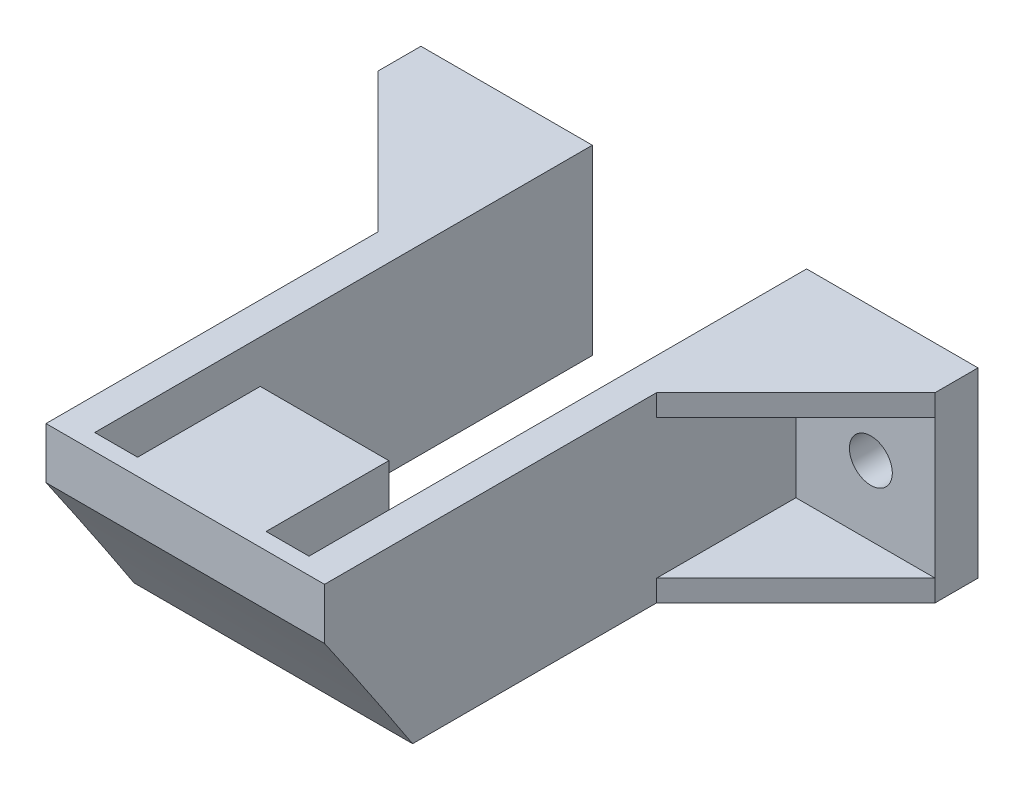
ISO-10303-21;
HEADER;
FILE_DESCRIPTION(('STEP AP214'),'2;1');
FILE_NAME('part.step','',(''),(''),'','','');
FILE_SCHEMA(('AUTOMOTIVE_DESIGN { 1 0 10303 214 1 1 1 1 }'));
ENDSEC;
DATA;
#1=APPLICATION_CONTEXT('core data for automotive mechanical design processes');
#2=APPLICATION_PROTOCOL_DEFINITION('international standard','automotive_design',2000,#1);
#3=PRODUCT_CONTEXT('',#1,'mechanical');
#4=PRODUCT('Part','Part','',(#3));
#5=PRODUCT_RELATED_PRODUCT_CATEGORY('part','',(#4));
#6=PRODUCT_DEFINITION_FORMATION('','',#4);
#7=PRODUCT_DEFINITION_CONTEXT('part definition',#1,'design');
#8=PRODUCT_DEFINITION('design','',#6,#7);
#9=PRODUCT_DEFINITION_SHAPE('','',#8);
#10=(LENGTH_UNIT() NAMED_UNIT(*) SI_UNIT(.MILLI.,.METRE.));
#11=(NAMED_UNIT(*) PLANE_ANGLE_UNIT() SI_UNIT($,.RADIAN.));
#12=(NAMED_UNIT(*) SI_UNIT($,.STERADIAN.) SOLID_ANGLE_UNIT());
#13=UNCERTAINTY_MEASURE_WITH_UNIT(LENGTH_MEASURE(1.E-05),#10,'distance_accuracy_value','');
#14=(GEOMETRIC_REPRESENTATION_CONTEXT(3) GLOBAL_UNCERTAINTY_ASSIGNED_CONTEXT((#13)) GLOBAL_UNIT_ASSIGNED_CONTEXT((#10,
#11,#12)) REPRESENTATION_CONTEXT('',''));
#15=CARTESIAN_POINT('',(0.,0.,0.));
#16=DIRECTION('',(0.,0.,1.));
#17=DIRECTION('',(1.,0.,0.));
#18=AXIS2_PLACEMENT_3D('',#15,#16,#17);
#19=CARTESIAN_POINT('',(28.0216094050633,17.,-27.3363714183997));
#20=DIRECTION('',(0.,0.,-1.));
#21=DIRECTION('',(-1.,0.,0.));
#22=AXIS2_PLACEMENT_3D('',#19,#20,#21);
#23=PLANE('',#22);
#24=CARTESIAN_POINT('',(22.0216094050633,8.5,-27.3363714183997));
#25=DIRECTION('',(0.,0.,-1.));
#26=DIRECTION('',(-1.,0.,0.));
#27=AXIS2_PLACEMENT_3D('',#24,#25,#26);
#28=CIRCLE('',#27,2.);
#29=CARTESIAN_POINT('',(20.0216094050633,8.5,-27.3363714183997));
#30=VERTEX_POINT('',#29);
#31=EDGE_CURVE('E356',#30,#30,#28,.T.);
#32=ORIENTED_EDGE('',*,*,#31,.T.);
#33=EDGE_LOOP('',(#32));
#34=FACE_BOUND('',#33,.T.);
#35=DIRECTION('',(1.,0.,0.));
#36=VECTOR('',#35,1.);
#37=CARTESIAN_POINT('',(28.0216094050633,2.,-27.3363714183997));
#38=LINE('',#37,#36);
#39=CARTESIAN_POINT('',(15.0216094050633,2.,-27.3363714183997));
#40=VERTEX_POINT('',#39);
#41=CARTESIAN_POINT('',(28.0216094050633,2.,-27.3363714183997));
#42=VERTEX_POINT('',#41);
#43=EDGE_CURVE('E359',#40,#42,#38,.T.);
#44=ORIENTED_EDGE('',*,*,#43,.T.);
#45=DIRECTION('',(0.,-1.,0.));
#46=VECTOR('',#45,1.);
#47=CARTESIAN_POINT('',(28.0216094050633,17.,-27.3363714183997));
#48=LINE('',#47,#46);
#49=CARTESIAN_POINT('',(28.0216094050633,15.,-27.3363714183997));
#50=VERTEX_POINT('',#49);
#51=EDGE_CURVE('E225',#50,#42,#48,.T.);
#52=ORIENTED_EDGE('',*,*,#51,.F.);
#53=DIRECTION('',(-1.,0.,0.));
#54=VECTOR('',#53,1.);
#55=CARTESIAN_POINT('',(15.0216094050633,15.,-27.3363714183997));
#56=LINE('',#55,#54);
#57=CARTESIAN_POINT('',(15.0216094050633,15.,-27.3363714183997));
#58=VERTEX_POINT('',#57);
#59=EDGE_CURVE('E322',#50,#58,#56,.T.);
#60=ORIENTED_EDGE('',*,*,#59,.T.);
#61=DIRECTION('',(0.,-1.,0.));
#62=VECTOR('',#61,1.);
#63=CARTESIAN_POINT('',(15.0216094050633,17.,-27.3363714183997));
#64=LINE('',#63,#62);
#65=EDGE_CURVE('E229',#58,#40,#64,.T.);
#66=ORIENTED_EDGE('',*,*,#65,.T.);
#67=EDGE_LOOP('',(#44,#52,#60,#66));
#68=FACE_BOUND('',#67,.T.);
#69=ADVANCED_FACE('F34',(#34,#68),#23,.F.);
#70=CARTESIAN_POINT('',(-23.9783905949367,17.,-27.3363714183997));
#71=DIRECTION('',(0.,0.,-1.));
#72=DIRECTION('',(-1.,0.,0.));
#73=AXIS2_PLACEMENT_3D('',#70,#71,#72);
#74=PLANE('',#73);
#75=CARTESIAN_POINT('',(-17.9783905949367,8.5,-27.3363714183997));
#76=DIRECTION('',(0.,0.,-1.));
#77=DIRECTION('',(-1.,0.,0.));
#78=AXIS2_PLACEMENT_3D('',#75,#76,#77);
#79=CIRCLE('',#78,2.);
#80=CARTESIAN_POINT('',(-19.9783905949367,8.5,-27.3363714183997));
#81=VERTEX_POINT('',#80);
#82=EDGE_CURVE('E367',#81,#81,#79,.T.);
#83=ORIENTED_EDGE('',*,*,#82,.T.);
#84=EDGE_LOOP('',(#83));
#85=FACE_BOUND('',#84,.T.);
#86=DIRECTION('',(1.,0.,0.));
#87=VECTOR('',#86,1.);
#88=CARTESIAN_POINT('',(-10.9783905949367,2.,-27.3363714183997));
#89=LINE('',#88,#87);
#90=CARTESIAN_POINT('',(-23.9783905949367,2.,-27.3363714183997));
#91=VERTEX_POINT('',#90);
#92=CARTESIAN_POINT('',(-10.9783905949367,2.,-27.3363714183997));
#93=VERTEX_POINT('',#92);
#94=EDGE_CURVE('E339',#91,#93,#89,.T.);
#95=ORIENTED_EDGE('',*,*,#94,.T.);
#96=DIRECTION('',(0.,-1.,0.));
#97=VECTOR('',#96,1.);
#98=CARTESIAN_POINT('',(-10.9783905949367,17.,-27.3363714183997));
#99=LINE('',#98,#97);
#100=CARTESIAN_POINT('',(-10.9783905949367,15.,-27.3363714183997));
#101=VERTEX_POINT('',#100);
#102=EDGE_CURVE('E238',#101,#93,#99,.T.);
#103=ORIENTED_EDGE('',*,*,#102,.F.);
#104=DIRECTION('',(-1.,0.,0.));
#105=VECTOR('',#104,1.);
#106=CARTESIAN_POINT('',(-10.9783905949367,15.,-27.3363714183997));
#107=LINE('',#106,#105);
#108=CARTESIAN_POINT('',(-23.9783905949367,15.,-27.3363714183997));
#109=VERTEX_POINT('',#108);
#110=EDGE_CURVE('E308',#101,#109,#107,.T.);
#111=ORIENTED_EDGE('',*,*,#110,.T.);
#112=DIRECTION('',(0.,-1.,0.));
#113=VECTOR('',#112,1.);
#114=CARTESIAN_POINT('',(-23.9783905949367,17.,-27.3363714183997));
#115=LINE('',#114,#113);
#116=EDGE_CURVE('E241',#109,#91,#115,.T.);
#117=ORIENTED_EDGE('',*,*,#116,.T.);
#118=EDGE_LOOP('',(#95,#103,#111,#117));
#119=FACE_BOUND('',#118,.T.);
#120=ADVANCED_FACE('F417',(#85,#119),#74,.F.);
#121=CARTESIAN_POINT('',(-7.97839059493666,17.,3.6636285816003));
#122=DIRECTION('',(-1.,0.,0.));
#123=DIRECTION('',(0.,0.,1.));
#124=AXIS2_PLACEMENT_3D('',#121,#122,#123);
#125=PLANE('',#124);
#126=DIRECTION('',(0.,0.,-1.));
#127=VECTOR('',#126,1.);
#128=CARTESIAN_POINT('',(-7.97839059493666,0.,3.6636285816003));
#129=LINE('',#128,#127);
#130=CARTESIAN_POINT('',(-7.97839059493666,0.,3.6636285816003));
#131=VERTEX_POINT('',#130);
#132=CARTESIAN_POINT('',(-7.97839059493666,0.,-31.3363714183997));
#133=VERTEX_POINT('',#132);
#134=EDGE_CURVE('E257',#131,#133,#129,.T.);
#135=ORIENTED_EDGE('',*,*,#134,.T.);
#136=DIRECTION('',(0.,-1.,0.));
#137=VECTOR('',#136,1.);
#138=CARTESIAN_POINT('',(-7.97839059493666,17.,-31.3363714183997));
#139=LINE('',#138,#137);
#140=CARTESIAN_POINT('',(-7.97839059493666,17.,-31.3363714183997));
#141=VERTEX_POINT('',#140);
#142=EDGE_CURVE('E42',#141,#133,#139,.T.);
#143=ORIENTED_EDGE('',*,*,#142,.F.);
#144=DIRECTION('',(0.,0.,-1.));
#145=VECTOR('',#144,1.);
#146=CARTESIAN_POINT('',(-7.97839059493666,17.,3.6636285816003));
#147=LINE('',#146,#145);
#148=CARTESIAN_POINT('',(-7.97839059493666,17.,15.1138601835558));
#149=VERTEX_POINT('',#148);
#150=EDGE_CURVE('E194',#149,#141,#147,.T.);
#151=ORIENTED_EDGE('',*,*,#150,.F.);
#152=CARTESIAN_POINT('',(-7.97839059493666,-326.636544148611,506.961321827509));
#153=DIRECTION('',(-1.,0.,0.));
#154=DIRECTION('',(0.,0.,-1.));
#155=AXIS2_PLACEMENT_3D('',#152,#153,#154);
#156=CIRCLE('',#155,600.);
#157=EDGE_CURVE('E258',#149,#131,#156,.T.);
#158=ORIENTED_EDGE('',*,*,#157,.T.);
#159=EDGE_LOOP('',(#135,#143,#151,#158));
#160=FACE_BOUND('',#159,.T.);
#161=ADVANCED_FACE('F36',(#160),#125,.F.);
#162=CARTESIAN_POINT('',(-7.97839059493666,17.,-31.3363714183997));
#163=DIRECTION('',(0.,0.,1.));
#164=DIRECTION('',(1.,0.,0.));
#165=AXIS2_PLACEMENT_3D('',#162,#163,#164);
#166=PLANE('',#165);
#167=CARTESIAN_POINT('',(-17.9783905949367,8.5,-31.3363714183997));
#168=DIRECTION('',(0.,0.,-1.));
#169=DIRECTION('',(-1.,0.,0.));
#170=AXIS2_PLACEMENT_3D('',#167,#168,#169);
#171=CIRCLE('',#170,2.);
#172=CARTESIAN_POINT('',(-19.9783905949367,8.5,-31.3363714183997));
#173=VERTEX_POINT('',#172);
#174=EDGE_CURVE('E370',#173,#173,#171,.T.);
#175=ORIENTED_EDGE('',*,*,#174,.F.);
#176=EDGE_LOOP('',(#175));
#177=FACE_BOUND('',#176,.T.);
#178=DIRECTION('',(-1.,0.,0.));
#179=VECTOR('',#178,1.);
#180=CARTESIAN_POINT('',(-7.97839059493666,0.,-31.3363714183997));
#181=LINE('',#180,#179);
#182=CARTESIAN_POINT('',(-23.9783905949367,0.,-31.3363714183997));
#183=VERTEX_POINT('',#182);
#184=EDGE_CURVE('E253',#133,#183,#181,.T.);
#185=ORIENTED_EDGE('',*,*,#184,.T.);
#186=DIRECTION('',(0.,-1.,0.));
#187=VECTOR('',#186,1.);
#188=CARTESIAN_POINT('',(-23.9783905949367,17.,-31.3363714183997));
#189=LINE('',#188,#187);
#190=CARTESIAN_POINT('',(-23.9783905949367,17.,-31.3363714183997));
#191=VERTEX_POINT('',#190);
#192=EDGE_CURVE('E244',#191,#183,#189,.T.);
#193=ORIENTED_EDGE('',*,*,#192,.F.);
#194=DIRECTION('',(-1.,0.,0.));
#195=VECTOR('',#194,1.);
#196=CARTESIAN_POINT('',(-7.97839059493666,17.,-31.3363714183997));
#197=LINE('',#196,#195);
#198=EDGE_CURVE('E254',#141,#191,#197,.T.);
#199=ORIENTED_EDGE('',*,*,#198,.F.);
#200=ORIENTED_EDGE('',*,*,#142,.T.);
#201=EDGE_LOOP('',(#185,#193,#199,#200));
#202=FACE_BOUND('',#201,.T.);
#203=ADVANCED_FACE('F250',(#177,#202),#166,.F.);
#204=CARTESIAN_POINT('',(-23.9783905949367,17.,-31.3363714183997));
#205=DIRECTION('',(1.,0.,0.));
#206=DIRECTION('',(0.,0.,-1.));
#207=AXIS2_PLACEMENT_3D('',#204,#205,#206);
#208=PLANE('',#207);
#209=DIRECTION('',(0.,0.,1.));
#210=VECTOR('',#209,1.);
#211=CARTESIAN_POINT('',(-23.9783905949367,0.,-31.3363714183997));
#212=LINE('',#211,#210);
#213=CARTESIAN_POINT('',(-23.9783905949367,0.,-27.3363714183997));
#214=VERTEX_POINT('',#213);
#215=EDGE_CURVE('E263',#183,#214,#212,.T.);
#216=ORIENTED_EDGE('',*,*,#215,.T.);
#217=DIRECTION('',(0.,-1.,0.));
#218=VECTOR('',#217,1.);
#219=CARTESIAN_POINT('',(-23.9783905949367,2.,-27.3363714183997));
#220=LINE('',#219,#218);
#221=EDGE_CURVE('E323',#91,#214,#220,.T.);
#222=ORIENTED_EDGE('',*,*,#221,.F.);
#223=ORIENTED_EDGE('',*,*,#116,.F.);
#224=CARTESIAN_POINT('',(-23.9783905949367,17.,-27.3363714183997));
#225=VERTEX_POINT('',#224);
#226=EDGE_CURVE('E242',#225,#109,#115,.T.);
#227=ORIENTED_EDGE('',*,*,#226,.F.);
#228=DIRECTION('',(0.,0.,1.));
#229=VECTOR('',#228,1.);
#230=CARTESIAN_POINT('',(-23.9783905949367,17.,-31.3363714183997));
#231=LINE('',#230,#229);
#232=EDGE_CURVE('E298',#191,#225,#231,.T.);
#233=ORIENTED_EDGE('',*,*,#232,.F.);
#234=ORIENTED_EDGE('',*,*,#192,.T.);
#235=EDGE_LOOP('',(#216,#222,#223,#227,#233,#234));
#236=FACE_BOUND('',#235,.T.);
#237=ADVANCED_FACE('F405',(#236),#208,.F.);
#238=CARTESIAN_POINT('',(-10.9783905949367,17.,16.6636285816003));
#239=DIRECTION('',(1.,0.,0.));
#240=DIRECTION('',(0.,0.,-1.));
#241=AXIS2_PLACEMENT_3D('',#238,#239,#240);
#242=PLANE('',#241);
#243=DIRECTION('',(0.,0.,1.));
#244=VECTOR('',#243,1.);
#245=CARTESIAN_POINT('',(-10.9783905949367,0.,16.6636285816003));
#246=LINE('',#245,#244);
#247=CARTESIAN_POINT('',(-10.9783905949367,0.,-14.3363714184));
#248=VERTEX_POINT('',#247);
#249=CARTESIAN_POINT('',(-10.9783905949367,0.,8.43893714789151));
#250=VERTEX_POINT('',#249);
#251=EDGE_CURVE('E265',#248,#250,#246,.T.);
#252=ORIENTED_EDGE('',*,*,#251,.T.);
#253=CARTESIAN_POINT('',(-10.9783905949367,-326.636544148611,506.961321827509));
#254=DIRECTION('',(-1.,0.,0.));
#255=DIRECTION('',(0.,0.,1.));
#256=AXIS2_PLACEMENT_3D('',#253,#254,#255);
#257=CIRCLE('',#256,596.);
#258=CARTESIAN_POINT('',(-10.9783905949367,12.2206115936588,16.6636285816003));
#259=VERTEX_POINT('',#258);
#260=EDGE_CURVE('E49',#259,#250,#257,.T.);
#261=ORIENTED_EDGE('',*,*,#260,.F.);
#262=DIRECTION('',(0.,-1.,0.));
#263=VECTOR('',#262,1.);
#264=CARTESIAN_POINT('',(-10.9783905949367,17.,16.6636285816003));
#265=LINE('',#264,#263);
#266=CARTESIAN_POINT('',(-10.9783905949367,17.,16.6636285816003));
#267=VERTEX_POINT('',#266);
#268=EDGE_CURVE('E235',#267,#259,#265,.T.);
#269=ORIENTED_EDGE('',*,*,#268,.F.);
#270=DIRECTION('',(0.,0.,1.));
#271=VECTOR('',#270,1.);
#272=CARTESIAN_POINT('',(-10.9783905949367,17.,-22.1528238790686));
#273=LINE('',#272,#271);
#274=CARTESIAN_POINT('',(-10.9783905949367,17.,-14.3363714184));
#275=VERTEX_POINT('',#274);
#276=EDGE_CURVE('E296',#275,#267,#273,.T.);
#277=ORIENTED_EDGE('',*,*,#276,.F.);
#278=DIRECTION('',(0.,1.,0.));
#279=VECTOR('',#278,1.);
#280=CARTESIAN_POINT('',(-10.9783905949367,15.,-14.3363714184));
#281=LINE('',#280,#279);
#282=CARTESIAN_POINT('',(-10.9783905949367,15.,-14.3363714184));
#283=VERTEX_POINT('',#282);
#284=EDGE_CURVE('E259',#283,#275,#281,.T.);
#285=ORIENTED_EDGE('',*,*,#284,.F.);
#286=DIRECTION('',(0.,0.,-1.));
#287=VECTOR('',#286,1.);
#288=CARTESIAN_POINT('',(-10.9783905949367,15.,-14.3363714184));
#289=LINE('',#288,#287);
#290=EDGE_CURVE('E305',#283,#101,#289,.T.);
#291=ORIENTED_EDGE('',*,*,#290,.T.);
#292=ORIENTED_EDGE('',*,*,#102,.T.);
#293=DIRECTION('',(0.,0.,1.));
#294=VECTOR('',#293,1.);
#295=CARTESIAN_POINT('',(-10.9783905949367,2.,-14.3363714184));
#296=LINE('',#295,#294);
#297=CARTESIAN_POINT('',(-10.9783905949367,2.,-14.3363714184));
#298=VERTEX_POINT('',#297);
#299=EDGE_CURVE('E343',#93,#298,#296,.T.);
#300=ORIENTED_EDGE('',*,*,#299,.T.);
#301=DIRECTION('',(0.,-1.,0.));
#302=VECTOR('',#301,1.);
#303=CARTESIAN_POINT('',(-10.9783905949367,2.,-14.3363714184));
#304=LINE('',#303,#302);
#305=EDGE_CURVE('E331',#298,#248,#304,.T.);
#306=ORIENTED_EDGE('',*,*,#305,.T.);
#307=EDGE_LOOP('',(#252,#261,#269,#277,#285,#291,#292,#300,#306));
#308=FACE_BOUND('',#307,.T.);
#309=ADVANCED_FACE('F421',(#308),#242,.F.);
#310=CARTESIAN_POINT('',(-10.9783905949367,17.,16.6636285816003));
#311=DIRECTION('',(0.,0.,-1.));
#312=DIRECTION('',(-1.,0.,0.));
#313=AXIS2_PLACEMENT_3D('',#310,#311,#312);
#314=PLANE('',#313);
#315=ORIENTED_EDGE('',*,*,#268,.T.);
#316=DIRECTION('',(-1.,0.,0.));
#317=VECTOR('',#316,1.);
#318=CARTESIAN_POINT('',(89.0216094050633,12.2206115936588,16.6636285816003));
#319=LINE('',#318,#317);
#320=CARTESIAN_POINT('',(15.0216094050633,12.2206115936588,16.6636285816003));
#321=VERTEX_POINT('',#320);
#322=EDGE_CURVE('E382',#259,#321,#319,.F.);
#323=ORIENTED_EDGE('',*,*,#322,.T.);
#324=DIRECTION('',(0.,-1.,0.));
#325=VECTOR('',#324,1.);
#326=CARTESIAN_POINT('',(15.0216094050633,17.,16.6636285816003));
#327=LINE('',#326,#325);
#328=CARTESIAN_POINT('',(15.0216094050633,17.,16.6636285816003));
#329=VERTEX_POINT('',#328);
#330=EDGE_CURVE('E232',#329,#321,#327,.T.);
#331=ORIENTED_EDGE('',*,*,#330,.F.);
#332=DIRECTION('',(1.,0.,0.));
#333=VECTOR('',#332,1.);
#334=CARTESIAN_POINT('',(-10.9783905949367,17.,16.6636285816003));
#335=LINE('',#334,#333);
#336=EDGE_CURVE('E294',#267,#329,#335,.T.);
#337=ORIENTED_EDGE('',*,*,#336,.F.);
#338=EDGE_LOOP('',(#315,#323,#331,#337));
#339=FACE_BOUND('',#338,.T.);
#340=ADVANCED_FACE('F437',(#339),#314,.F.);
#341=CARTESIAN_POINT('',(15.0216094050633,17.,-27.3363714183997));
#342=DIRECTION('',(-1.,0.,0.));
#343=DIRECTION('',(0.,0.,1.));
#344=AXIS2_PLACEMENT_3D('',#341,#342,#343);
#345=PLANE('',#344);
#346=ORIENTED_EDGE('',*,*,#330,.T.);
#347=CARTESIAN_POINT('',(15.0216094050634,-326.636544148611,506.961321827509));
#348=DIRECTION('',(-1.,0.,0.));
#349=DIRECTION('',(0.,0.,1.));
#350=AXIS2_PLACEMENT_3D('',#347,#348,#349);
#351=CIRCLE('',#350,596.);
#352=CARTESIAN_POINT('',(15.0216094050633,0.,8.43893714789151));
#353=VERTEX_POINT('',#352);
#354=EDGE_CURVE('E388',#321,#353,#351,.T.);
#355=ORIENTED_EDGE('',*,*,#354,.T.);
#356=DIRECTION('',(0.,0.,-1.));
#357=VECTOR('',#356,1.);
#358=CARTESIAN_POINT('',(15.0216094050633,0.,-27.3363714183997));
#359=LINE('',#358,#357);
#360=CARTESIAN_POINT('',(15.0216094050633,0.,-14.3363714183994));
#361=VERTEX_POINT('',#360);
#362=EDGE_CURVE('E271',#353,#361,#359,.T.);
#363=ORIENTED_EDGE('',*,*,#362,.T.);
#364=DIRECTION('',(0.,-1.,0.));
#365=VECTOR('',#364,1.);
#366=CARTESIAN_POINT('',(15.0216094050633,2.,-14.3363714183994));
#367=LINE('',#366,#365);
#368=CARTESIAN_POINT('',(15.0216094050633,2.,-14.3363714183994));
#369=VERTEX_POINT('',#368);
#370=EDGE_CURVE('E340',#369,#361,#367,.T.);
#371=ORIENTED_EDGE('',*,*,#370,.F.);
#372=DIRECTION('',(0.,0.,-1.));
#373=VECTOR('',#372,1.);
#374=CARTESIAN_POINT('',(15.0216094050633,2.,-27.3363714183997));
#375=LINE('',#374,#373);
#376=EDGE_CURVE('E355',#369,#40,#375,.T.);
#377=ORIENTED_EDGE('',*,*,#376,.T.);
#378=ORIENTED_EDGE('',*,*,#65,.F.);
#379=DIRECTION('',(0.,0.,1.));
#380=VECTOR('',#379,1.);
#381=CARTESIAN_POINT('',(15.0216094050633,15.,-14.3363714183994));
#382=LINE('',#381,#380);
#383=CARTESIAN_POINT('',(15.0216094050633,15.,-14.3363714183994));
#384=VERTEX_POINT('',#383);
#385=EDGE_CURVE('E326',#58,#384,#382,.T.);
#386=ORIENTED_EDGE('',*,*,#385,.T.);
#387=DIRECTION('',(0.,1.,0.));
#388=VECTOR('',#387,1.);
#389=CARTESIAN_POINT('',(15.0216094050633,15.,-14.3363714183994));
#390=LINE('',#389,#388);
#391=CARTESIAN_POINT('',(15.0216094050633,17.,-14.3363714183994));
#392=VERTEX_POINT('',#391);
#393=EDGE_CURVE('E309',#384,#392,#390,.T.);
#394=ORIENTED_EDGE('',*,*,#393,.T.);
#395=DIRECTION('',(0.,0.,-1.));
#396=VECTOR('',#395,1.);
#397=CARTESIAN_POINT('',(15.0216094050633,17.,16.6636285816003));
#398=LINE('',#397,#396);
#399=EDGE_CURVE('E291',#329,#392,#398,.T.);
#400=ORIENTED_EDGE('',*,*,#399,.F.);
#401=EDGE_LOOP('',(#346,#355,#363,#371,#377,#378,#386,#394,#400));
#402=FACE_BOUND('',#401,.T.);
#403=ADVANCED_FACE('F432',(#402),#345,.F.);
#404=CARTESIAN_POINT('',(28.0216094050633,17.,-31.3363714183997));
#405=DIRECTION('',(-1.,0.,0.));
#406=DIRECTION('',(0.,0.,1.));
#407=AXIS2_PLACEMENT_3D('',#404,#405,#406);
#408=PLANE('',#407);
#409=DIRECTION('',(0.,0.,-1.));
#410=VECTOR('',#409,1.);
#411=CARTESIAN_POINT('',(28.0216094050633,0.,-31.3363714183997));
#412=LINE('',#411,#410);
#413=CARTESIAN_POINT('',(28.0216094050633,0.,-27.3363714183997));
#414=VERTEX_POINT('',#413);
#415=CARTESIAN_POINT('',(28.0216094050633,0.,-31.3363714183997));
#416=VERTEX_POINT('',#415);
#417=EDGE_CURVE('E273',#414,#416,#412,.T.);
#418=ORIENTED_EDGE('',*,*,#417,.T.);
#419=DIRECTION('',(0.,-1.,0.));
#420=VECTOR('',#419,1.);
#421=CARTESIAN_POINT('',(28.0216094050633,17.,-31.3363714183997));
#422=LINE('',#421,#420);
#423=CARTESIAN_POINT('',(28.0216094050633,17.,-31.3363714183997));
#424=VERTEX_POINT('',#423);
#425=EDGE_CURVE('E222',#424,#416,#422,.T.);
#426=ORIENTED_EDGE('',*,*,#425,.F.);
#427=DIRECTION('',(0.,0.,-1.));
#428=VECTOR('',#427,1.);
#429=CARTESIAN_POINT('',(28.0216094050633,17.,-31.3363714183997));
#430=LINE('',#429,#428);
#431=CARTESIAN_POINT('',(28.0216094050633,17.,-27.3363714183997));
#432=VERTEX_POINT('',#431);
#433=EDGE_CURVE('E287',#432,#424,#430,.T.);
#434=ORIENTED_EDGE('',*,*,#433,.F.);
#435=EDGE_CURVE('E226',#432,#50,#48,.T.);
#436=ORIENTED_EDGE('',*,*,#435,.T.);
#437=ORIENTED_EDGE('',*,*,#51,.T.);
#438=DIRECTION('',(0.,-1.,0.));
#439=VECTOR('',#438,1.);
#440=CARTESIAN_POINT('',(28.0216094050633,2.,-27.3363714183997));
#441=LINE('',#440,#439);
#442=EDGE_CURVE('E346',#42,#414,#441,.T.);
#443=ORIENTED_EDGE('',*,*,#442,.T.);
#444=EDGE_LOOP('',(#418,#426,#434,#436,#437,#443));
#445=FACE_BOUND('',#444,.T.);
#446=ADVANCED_FACE('F442',(#445),#408,.F.);
#447=CARTESIAN_POINT('',(12.0216094050633,17.,-31.3363714183997));
#448=DIRECTION('',(0.,0.,1.));
#449=DIRECTION('',(1.,0.,0.));
#450=AXIS2_PLACEMENT_3D('',#447,#448,#449);
#451=PLANE('',#450);
#452=CARTESIAN_POINT('',(22.0216094050633,8.5,-31.3363714183997));
#453=DIRECTION('',(0.,0.,-1.));
#454=DIRECTION('',(-1.,0.,0.));
#455=AXIS2_PLACEMENT_3D('',#452,#453,#454);
#456=CIRCLE('',#455,2.);
#457=CARTESIAN_POINT('',(20.0216094050633,8.5,-31.3363714183997));
#458=VERTEX_POINT('',#457);
#459=EDGE_CURVE('E364',#458,#458,#456,.T.);
#460=ORIENTED_EDGE('',*,*,#459,.F.);
#461=EDGE_LOOP('',(#460));
#462=FACE_BOUND('',#461,.T.);
#463=DIRECTION('',(-1.,0.,0.));
#464=VECTOR('',#463,1.);
#465=CARTESIAN_POINT('',(12.0216094050633,0.,-31.3363714183997));
#466=LINE('',#465,#464);
#467=CARTESIAN_POINT('',(12.0216094050633,0.,-31.3363714183997));
#468=VERTEX_POINT('',#467);
#469=EDGE_CURVE('E215',#416,#468,#466,.T.);
#470=ORIENTED_EDGE('',*,*,#469,.T.);
#471=DIRECTION('',(0.,-1.,0.));
#472=VECTOR('',#471,1.);
#473=CARTESIAN_POINT('',(12.0216094050633,17.,-31.3363714183997));
#474=LINE('',#473,#472);
#475=CARTESIAN_POINT('',(12.0216094050633,17.,-31.3363714183997));
#476=VERTEX_POINT('',#475);
#477=EDGE_CURVE('E219',#476,#468,#474,.T.);
#478=ORIENTED_EDGE('',*,*,#477,.F.);
#479=DIRECTION('',(-1.,0.,0.));
#480=VECTOR('',#479,1.);
#481=CARTESIAN_POINT('',(12.0216094050633,17.,-31.3363714183997));
#482=LINE('',#481,#480);
#483=EDGE_CURVE('E285',#424,#476,#482,.T.);
#484=ORIENTED_EDGE('',*,*,#483,.F.);
#485=ORIENTED_EDGE('',*,*,#425,.T.);
#486=EDGE_LOOP('',(#470,#478,#484,#485));
#487=FACE_BOUND('',#486,.T.);
#488=ADVANCED_FACE('F277',(#462,#487),#451,.F.);
#489=CARTESIAN_POINT('',(12.0216094050633,17.,3.6636285816003));
#490=DIRECTION('',(1.,0.,0.));
#491=DIRECTION('',(0.,0.,-1.));
#492=AXIS2_PLACEMENT_3D('',#489,#490,#491);
#493=PLANE('',#492);
#494=CARTESIAN_POINT('',(12.0216094050633,-326.636544148611,506.961321827509));
#495=DIRECTION('',(1.,0.,0.));
#496=DIRECTION('',(0.,0.,1.));
#497=AXIS2_PLACEMENT_3D('',#494,#495,#496);
#498=CIRCLE('',#497,600.);
#499=CARTESIAN_POINT('',(12.0216094050633,0.,3.6636285816003));
#500=VERTEX_POINT('',#499);
#501=CARTESIAN_POINT('',(12.0216094050633,17.,15.1138601835556));
#502=VERTEX_POINT('',#501);
#503=EDGE_CURVE('E191',#500,#502,#498,.T.);
#504=ORIENTED_EDGE('',*,*,#503,.T.);
#505=DIRECTION('',(0.,0.,1.));
#506=VECTOR('',#505,1.);
#507=CARTESIAN_POINT('',(12.0216094050633,17.,3.6636285816003));
#508=LINE('',#507,#506);
#509=EDGE_CURVE('E283',#476,#502,#508,.T.);
#510=ORIENTED_EDGE('',*,*,#509,.F.);
#511=ORIENTED_EDGE('',*,*,#477,.T.);
#512=DIRECTION('',(0.,0.,1.));
#513=VECTOR('',#512,1.);
#514=CARTESIAN_POINT('',(12.0216094050633,0.,3.6636285816003));
#515=LINE('',#514,#513);
#516=EDGE_CURVE('E214',#468,#500,#515,.T.);
#517=ORIENTED_EDGE('',*,*,#516,.T.);
#518=EDGE_LOOP('',(#504,#510,#511,#517));
#519=FACE_BOUND('',#518,.T.);
#520=ADVANCED_FACE('F282',(#519),#493,.F.);
#521=CARTESIAN_POINT('',(-7.97839059493666,17.,3.6636285816003));
#522=DIRECTION('',(0.,0.,1.));
#523=DIRECTION('',(1.,0.,0.));
#524=AXIS2_PLACEMENT_3D('',#521,#522,#523);
#525=PLANE('',#524);
#526=DIRECTION('',(-1.,0.,0.));
#527=VECTOR('',#526,1.);
#528=CARTESIAN_POINT('',(-7.97839059493666,17.,3.6636285816003));
#529=LINE('',#528,#527);
#530=CARTESIAN_POINT('',(8.02160940506334,17.,3.6636285816003));
#531=VERTEX_POINT('',#530);
#532=CARTESIAN_POINT('',(-3.97839059493666,17.,3.66362858160029));
#533=VERTEX_POINT('',#532);
#534=EDGE_CURVE('E206',#531,#533,#529,.T.);
#535=ORIENTED_EDGE('',*,*,#534,.F.);
#536=DIRECTION('',(0.,-1.,0.));
#537=VECTOR('',#536,1.);
#538=CARTESIAN_POINT('',(8.02160940506334,17.,3.6636285816003));
#539=LINE('',#538,#537);
#540=CARTESIAN_POINT('',(8.02160940506334,0.,3.6636285816003));
#541=VERTEX_POINT('',#540);
#542=EDGE_CURVE('E198',#531,#541,#539,.T.);
#543=ORIENTED_EDGE('',*,*,#542,.T.);
#544=DIRECTION('',(-1.,0.,0.));
#545=VECTOR('',#544,1.);
#546=CARTESIAN_POINT('',(-7.97839059493666,0.,3.6636285816003));
#547=LINE('',#546,#545);
#548=CARTESIAN_POINT('',(-3.97839059493666,0.,3.6636285816003));
#549=VERTEX_POINT('',#548);
#550=EDGE_CURVE('E56',#541,#549,#547,.T.);
#551=ORIENTED_EDGE('',*,*,#550,.T.);
#552=DIRECTION('',(0.,1.,0.));
#553=VECTOR('',#552,1.);
#554=CARTESIAN_POINT('',(-3.97839059493666,17.,3.6636285816003));
#555=LINE('',#554,#553);
#556=EDGE_CURVE('E373',#549,#533,#555,.T.);
#557=ORIENTED_EDGE('',*,*,#556,.T.);
#558=EDGE_LOOP('',(#535,#543,#551,#557));
#559=FACE_BOUND('',#558,.T.);
#560=ADVANCED_FACE('F205',(#559),#525,.F.);
#561=CARTESIAN_POINT('',(0.,17.,0.));
#562=DIRECTION('',(0.,1.,0.));
#563=DIRECTION('',(0.,0.,1.));
#564=AXIS2_PLACEMENT_3D('',#561,#562,#563);
#565=PLANE('',#564);
#566=DIRECTION('',(0.,0.,-1.));
#567=VECTOR('',#566,1.);
#568=CARTESIAN_POINT('',(8.02160940506334,17.,-11.1882238113764));
#569=LINE('',#568,#567);
#570=CARTESIAN_POINT('',(8.02160940506334,17.,15.1138601835556));
#571=VERTEX_POINT('',#570);
#572=EDGE_CURVE('E200',#571,#531,#569,.T.);
#573=ORIENTED_EDGE('',*,*,#572,.T.);
#574=ORIENTED_EDGE('',*,*,#534,.T.);
#575=DIRECTION('',(0.,0.,1.));
#576=VECTOR('',#575,1.);
#577=CARTESIAN_POINT('',(-3.97839059493666,17.,-6.66026006781967));
#578=LINE('',#577,#576);
#579=CARTESIAN_POINT('',(-3.97839059493666,17.,15.1138601835558));
#580=VERTEX_POINT('',#579);
#581=EDGE_CURVE('E381',#533,#580,#578,.T.);
#582=ORIENTED_EDGE('',*,*,#581,.T.);
#583=DIRECTION('',(-1.,0.,0.));
#584=VECTOR('',#583,1.);
#585=CARTESIAN_POINT('',(-3.97839059493666,17.,15.1138601835558));
#586=LINE('',#585,#584);
#587=EDGE_CURVE('E375',#580,#149,#586,.T.);
#588=ORIENTED_EDGE('',*,*,#587,.T.);
#589=ORIENTED_EDGE('',*,*,#150,.T.);
#590=ORIENTED_EDGE('',*,*,#198,.T.);
#591=ORIENTED_EDGE('',*,*,#232,.T.);
#592=DIRECTION('',(0.707106781186556,0.,0.707106781186539));
#593=VECTOR('',#592,1.);
#594=CARTESIAN_POINT('',(-23.9783905949367,17.,-27.3363714183997));
#595=LINE('',#594,#593);
#596=EDGE_CURVE('E306',#225,#275,#595,.T.);
#597=ORIENTED_EDGE('',*,*,#596,.T.);
#598=ORIENTED_EDGE('',*,*,#276,.T.);
#599=ORIENTED_EDGE('',*,*,#336,.T.);
#600=ORIENTED_EDGE('',*,*,#399,.T.);
#601=DIRECTION('',(0.707106781186539,0.,-0.707106781186556));
#602=VECTOR('',#601,1.);
#603=CARTESIAN_POINT('',(28.0216094050633,17.,-27.3363714183997));
#604=LINE('',#603,#602);
#605=EDGE_CURVE('E319',#392,#432,#604,.T.);
#606=ORIENTED_EDGE('',*,*,#605,.T.);
#607=ORIENTED_EDGE('',*,*,#433,.T.);
#608=ORIENTED_EDGE('',*,*,#483,.T.);
#609=ORIENTED_EDGE('',*,*,#509,.T.);
#610=DIRECTION('',(1.,0.,0.));
#611=VECTOR('',#610,1.);
#612=CARTESIAN_POINT('',(8.02160940506334,17.,15.1138601835556));
#613=LINE('',#612,#611);
#614=EDGE_CURVE('E202',#571,#502,#613,.T.);
#615=ORIENTED_EDGE('',*,*,#614,.F.);
#616=EDGE_LOOP('',(#573,#574,#582,#588,#589,#590,#591,#597,#598,#599,#600,#606,#607,#608,#609,#615));
#617=FACE_BOUND('',#616,.T.);
#618=ADVANCED_FACE('F394',(#617),#565,.T.);
#619=CARTESIAN_POINT('',(0.,0.,0.));
#620=DIRECTION('',(0.,1.,0.));
#621=DIRECTION('',(0.,0.,1.));
#622=AXIS2_PLACEMENT_3D('',#619,#620,#621);
#623=PLANE('',#622);
#624=ORIENTED_EDGE('',*,*,#362,.F.);
#625=DIRECTION('',(-1.,0.,0.));
#626=VECTOR('',#625,1.);
#627=CARTESIAN_POINT('',(89.0216094050633,0.,8.43893714789151));
#628=LINE('',#627,#626);
#629=EDGE_CURVE('E11',#353,#250,#628,.T.);
#630=ORIENTED_EDGE('',*,*,#629,.T.);
#631=ORIENTED_EDGE('',*,*,#251,.F.);
#632=DIRECTION('',(-0.707106781186556,0.,-0.707106781186539));
#633=VECTOR('',#632,1.);
#634=CARTESIAN_POINT('',(-23.9783905949367,0.,-27.3363714183997));
#635=LINE('',#634,#633);
#636=EDGE_CURVE('E337',#248,#214,#635,.T.);
#637=ORIENTED_EDGE('',*,*,#636,.T.);
#638=ORIENTED_EDGE('',*,*,#215,.F.);
#639=ORIENTED_EDGE('',*,*,#184,.F.);
#640=ORIENTED_EDGE('',*,*,#134,.F.);
#641=DIRECTION('',(-1.,0.,0.));
#642=VECTOR('',#641,1.);
#643=CARTESIAN_POINT('',(-3.97839059493666,0.,3.6636285816003));
#644=LINE('',#643,#642);
#645=EDGE_CURVE('E213',#549,#131,#644,.T.);
#646=ORIENTED_EDGE('',*,*,#645,.F.);
#647=ORIENTED_EDGE('',*,*,#550,.F.);
#648=EDGE_CURVE('E184',#500,#541,#547,.T.);
#649=ORIENTED_EDGE('',*,*,#648,.F.);
#650=ORIENTED_EDGE('',*,*,#516,.F.);
#651=ORIENTED_EDGE('',*,*,#469,.F.);
#652=ORIENTED_EDGE('',*,*,#417,.F.);
#653=DIRECTION('',(-0.707106781186539,0.,0.707106781186556));
#654=VECTOR('',#653,1.);
#655=CARTESIAN_POINT('',(15.0216094050633,0.,-14.3363714183994));
#656=LINE('',#655,#654);
#657=EDGE_CURVE('E352',#414,#361,#656,.T.);
#658=ORIENTED_EDGE('',*,*,#657,.T.);
#659=EDGE_LOOP('',(#624,#630,#631,#637,#638,#639,#640,#646,#647,#649,#650,#651,#652,#658));
#660=FACE_BOUND('',#659,.T.);
#661=ADVANCED_FACE('F210',(#660),#623,.F.);
#662=CARTESIAN_POINT('',(-23.9783905949367,15.,-27.3363714183997));
#663=DIRECTION('',(-0.707106781186539,0.,0.707106781186556));
#664=DIRECTION('',(0.707106781186556,0.,0.707106781186539));
#665=AXIS2_PLACEMENT_3D('',#662,#663,#664);
#666=PLANE('',#665);
#667=ORIENTED_EDGE('',*,*,#596,.F.);
#668=ORIENTED_EDGE('',*,*,#226,.T.);
#669=DIRECTION('',(0.707106781186556,0.,0.707106781186539));
#670=VECTOR('',#669,1.);
#671=CARTESIAN_POINT('',(-23.9783905949367,15.,-27.3363714183997));
#672=LINE('',#671,#670);
#673=EDGE_CURVE('E312',#109,#283,#672,.T.);
#674=ORIENTED_EDGE('',*,*,#673,.T.);
#675=ORIENTED_EDGE('',*,*,#284,.T.);
#676=EDGE_LOOP('',(#667,#668,#674,#675));
#677=FACE_BOUND('',#676,.T.);
#678=ADVANCED_FACE('F410',(#677),#666,.T.);
#679=CARTESIAN_POINT('',(0.,15.,0.));
#680=DIRECTION('',(0.,-1.,0.));
#681=DIRECTION('',(0.,0.,-1.));
#682=AXIS2_PLACEMENT_3D('',#679,#680,#681);
#683=PLANE('',#682);
#684=ORIENTED_EDGE('',*,*,#110,.F.);
#685=ORIENTED_EDGE('',*,*,#290,.F.);
#686=ORIENTED_EDGE('',*,*,#673,.F.);
#687=EDGE_LOOP('',(#684,#685,#686));
#688=FACE_BOUND('',#687,.T.);
#689=ADVANCED_FACE('F413',(#688),#683,.T.);
#690=CARTESIAN_POINT('',(28.0216094050633,15.,-27.3363714183997));
#691=DIRECTION('',(0.707106781186556,0.,0.707106781186539));
#692=DIRECTION('',(0.707106781186539,0.,-0.707106781186556));
#693=AXIS2_PLACEMENT_3D('',#690,#691,#692);
#694=PLANE('',#693);
#695=ORIENTED_EDGE('',*,*,#605,.F.);
#696=ORIENTED_EDGE('',*,*,#393,.F.);
#697=DIRECTION('',(0.707106781186539,0.,-0.707106781186556));
#698=VECTOR('',#697,1.);
#699=CARTESIAN_POINT('',(28.0216094050633,15.,-27.3363714183997));
#700=LINE('',#699,#698);
#701=EDGE_CURVE('E318',#384,#50,#700,.T.);
#702=ORIENTED_EDGE('',*,*,#701,.T.);
#703=ORIENTED_EDGE('',*,*,#435,.F.);
#704=EDGE_LOOP('',(#695,#696,#702,#703));
#705=FACE_BOUND('',#704,.T.);
#706=ADVANCED_FACE('F459',(#705),#694,.T.);
#707=CARTESIAN_POINT('',(0.,15.,0.));
#708=DIRECTION('',(0.,1.,0.));
#709=DIRECTION('',(0.,0.,1.));
#710=AXIS2_PLACEMENT_3D('',#707,#708,#709);
#711=PLANE('',#710);
#712=ORIENTED_EDGE('',*,*,#59,.F.);
#713=ORIENTED_EDGE('',*,*,#701,.F.);
#714=ORIENTED_EDGE('',*,*,#385,.F.);
#715=EDGE_LOOP('',(#712,#713,#714));
#716=FACE_BOUND('',#715,.T.);
#717=ADVANCED_FACE('F458',(#716),#711,.F.);
#718=CARTESIAN_POINT('',(-23.9783905949367,2.,-27.3363714183997));
#719=DIRECTION('',(-0.707106781186539,0.,0.707106781186556));
#720=DIRECTION('',(0.707106781186556,0.,0.707106781186539));
#721=AXIS2_PLACEMENT_3D('',#718,#719,#720);
#722=PLANE('',#721);
#723=ORIENTED_EDGE('',*,*,#636,.F.);
#724=ORIENTED_EDGE('',*,*,#305,.F.);
#725=DIRECTION('',(-0.707106781186556,0.,-0.707106781186539));
#726=VECTOR('',#725,1.);
#727=CARTESIAN_POINT('',(-23.9783905949367,2.,-27.3363714183997));
#728=LINE('',#727,#726);
#729=EDGE_CURVE('E334',#298,#91,#728,.T.);
#730=ORIENTED_EDGE('',*,*,#729,.T.);
#731=ORIENTED_EDGE('',*,*,#221,.T.);
#732=EDGE_LOOP('',(#723,#724,#730,#731));
#733=FACE_BOUND('',#732,.T.);
#734=ADVANCED_FACE('F428',(#733),#722,.T.);
#735=CARTESIAN_POINT('',(0.,2.,0.));
#736=DIRECTION('',(0.,-1.,0.));
#737=DIRECTION('',(0.,0.,-1.));
#738=AXIS2_PLACEMENT_3D('',#735,#736,#737);
#739=PLANE('',#738);
#740=ORIENTED_EDGE('',*,*,#94,.F.);
#741=ORIENTED_EDGE('',*,*,#729,.F.);
#742=ORIENTED_EDGE('',*,*,#299,.F.);
#743=EDGE_LOOP('',(#740,#741,#742));
#744=FACE_BOUND('',#743,.T.);
#745=ADVANCED_FACE('F425',(#744),#739,.F.);
#746=CARTESIAN_POINT('',(15.0216094050633,2.,-14.3363714183994));
#747=DIRECTION('',(0.707106781186556,0.,0.707106781186539));
#748=DIRECTION('',(0.707106781186539,0.,-0.707106781186556));
#749=AXIS2_PLACEMENT_3D('',#746,#747,#748);
#750=PLANE('',#749);
#751=ORIENTED_EDGE('',*,*,#657,.F.);
#752=ORIENTED_EDGE('',*,*,#442,.F.);
#753=DIRECTION('',(-0.707106781186539,0.,0.707106781186556));
#754=VECTOR('',#753,1.);
#755=CARTESIAN_POINT('',(15.0216094050633,2.,-14.3363714183994));
#756=LINE('',#755,#754);
#757=EDGE_CURVE('E349',#42,#369,#756,.T.);
#758=ORIENTED_EDGE('',*,*,#757,.T.);
#759=ORIENTED_EDGE('',*,*,#370,.T.);
#760=EDGE_LOOP('',(#751,#752,#758,#759));
#761=FACE_BOUND('',#760,.T.);
#762=ADVANCED_FACE('F447',(#761),#750,.T.);
#763=CARTESIAN_POINT('',(0.,2.,0.));
#764=DIRECTION('',(0.,-1.,0.));
#765=DIRECTION('',(0.,0.,-1.));
#766=AXIS2_PLACEMENT_3D('',#763,#764,#765);
#767=PLANE('',#766);
#768=ORIENTED_EDGE('',*,*,#376,.F.);
#769=ORIENTED_EDGE('',*,*,#757,.F.);
#770=ORIENTED_EDGE('',*,*,#43,.F.);
#771=EDGE_LOOP('',(#768,#769,#770));
#772=FACE_BOUND('',#771,.T.);
#773=ADVANCED_FACE('F453',(#772),#767,.F.);
#774=CARTESIAN_POINT('',(22.0216094050633,8.5,-21.3363714183997));
#775=DIRECTION('',(0.,0.,-1.));
#776=DIRECTION('',(-1.,0.,0.));
#777=AXIS2_PLACEMENT_3D('',#774,#775,#776);
#778=CYLINDRICAL_SURFACE('',#777,2.);
#779=ORIENTED_EDGE('',*,*,#459,.T.);
#780=EDGE_LOOP('',(#779));
#781=FACE_BOUND('',#780,.T.);
#782=ORIENTED_EDGE('',*,*,#31,.F.);
#783=EDGE_LOOP('',(#782));
#784=FACE_BOUND('',#783,.T.);
#785=ADVANCED_FACE('F496',(#781,#784),#778,.F.);
#786=CARTESIAN_POINT('',(-17.9783905949367,8.5,-21.3363714183997));
#787=DIRECTION('',(0.,0.,-1.));
#788=DIRECTION('',(-1.,0.,0.));
#789=AXIS2_PLACEMENT_3D('',#786,#787,#788);
#790=CYLINDRICAL_SURFACE('',#789,2.);
#791=ORIENTED_EDGE('',*,*,#174,.T.);
#792=EDGE_LOOP('',(#791));
#793=FACE_BOUND('',#792,.T.);
#794=ORIENTED_EDGE('',*,*,#82,.F.);
#795=EDGE_LOOP('',(#794));
#796=FACE_BOUND('',#795,.T.);
#797=ADVANCED_FACE('F493',(#793,#796),#790,.F.);
#798=CARTESIAN_POINT('',(-3.97839059493666,-326.636544148611,506.961321827509));
#799=DIRECTION('',(1.,0.,0.));
#800=DIRECTION('',(0.,0.,-1.));
#801=AXIS2_PLACEMENT_3D('',#798,#799,#800);
#802=PLANE('',#801);
#803=CARTESIAN_POINT('',(-3.97839059493666,-326.636544148611,506.961321827509));
#804=DIRECTION('',(-1.,0.,0.));
#805=DIRECTION('',(0.,0.,-1.));
#806=AXIS2_PLACEMENT_3D('',#803,#804,#805);
#807=CIRCLE('',#806,600.);
#808=EDGE_CURVE('E379',#580,#549,#807,.T.);
#809=ORIENTED_EDGE('',*,*,#808,.F.);
#810=ORIENTED_EDGE('',*,*,#581,.F.);
#811=ORIENTED_EDGE('',*,*,#556,.F.);
#812=EDGE_LOOP('',(#809,#810,#811));
#813=FACE_BOUND('',#812,.T.);
#814=ADVANCED_FACE('F399',(#813),#802,.F.);
#815=CARTESIAN_POINT('',(-3.97839059493666,-326.636544148611,506.961321827509));
#816=DIRECTION('',(-1.,0.,0.));
#817=DIRECTION('',(0.,0.,1.));
#818=AXIS2_PLACEMENT_3D('',#815,#816,#817);
#819=CYLINDRICAL_SURFACE('',#818,600.);
#820=ORIENTED_EDGE('',*,*,#157,.F.);
#821=ORIENTED_EDGE('',*,*,#587,.F.);
#822=ORIENTED_EDGE('',*,*,#808,.T.);
#823=ORIENTED_EDGE('',*,*,#645,.T.);
#824=EDGE_LOOP('',(#820,#821,#822,#823));
#825=FACE_BOUND('',#824,.T.);
#826=ADVANCED_FACE('F401',(#825),#819,.T.);
#827=CARTESIAN_POINT('',(89.0216094050633,-326.636544148611,506.961321827509));
#828=DIRECTION('',(-1.,0.,0.));
#829=DIRECTION('',(0.,0.,1.));
#830=AXIS2_PLACEMENT_3D('',#827,#828,#829);
#831=CYLINDRICAL_SURFACE('',#830,596.);
#832=ORIENTED_EDGE('',*,*,#260,.T.);
#833=ORIENTED_EDGE('',*,*,#629,.F.);
#834=ORIENTED_EDGE('',*,*,#354,.F.);
#835=ORIENTED_EDGE('',*,*,#322,.F.);
#836=EDGE_LOOP('',(#832,#833,#834,#835));
#837=FACE_BOUND('',#836,.T.);
#838=ADVANCED_FACE('F430',(#837),#831,.F.);
#839=CARTESIAN_POINT('',(8.02160940506334,-326.636544148611,506.961321827509));
#840=DIRECTION('',(-1.,0.,0.));
#841=DIRECTION('',(0.,0.,1.));
#842=AXIS2_PLACEMENT_3D('',#839,#840,#841);
#843=PLANE('',#842);
#844=ORIENTED_EDGE('',*,*,#572,.F.);
#845=CARTESIAN_POINT('',(8.02160940506334,-326.636544148611,506.961321827509));
#846=DIRECTION('',(1.,0.,0.));
#847=DIRECTION('',(0.,0.,1.));
#848=AXIS2_PLACEMENT_3D('',#845,#846,#847);
#849=CIRCLE('',#848,600.);
#850=EDGE_CURVE('E188',#541,#571,#849,.T.);
#851=ORIENTED_EDGE('',*,*,#850,.F.);
#852=ORIENTED_EDGE('',*,*,#542,.F.);
#853=EDGE_LOOP('',(#844,#851,#852));
#854=FACE_BOUND('',#853,.T.);
#855=ADVANCED_FACE('F197',(#854),#843,.F.);
#856=CARTESIAN_POINT('',(8.02160940506334,-326.636544148611,506.961321827509));
#857=DIRECTION('',(1.,0.,0.));
#858=DIRECTION('',(0.,0.,-1.));
#859=AXIS2_PLACEMENT_3D('',#856,#857,#858);
#860=CYLINDRICAL_SURFACE('',#859,600.);
#861=ORIENTED_EDGE('',*,*,#503,.F.);
#862=ORIENTED_EDGE('',*,*,#648,.T.);
#863=ORIENTED_EDGE('',*,*,#850,.T.);
#864=ORIENTED_EDGE('',*,*,#614,.T.);
#865=EDGE_LOOP('',(#861,#862,#863,#864));
#866=FACE_BOUND('',#865,.T.);
#867=ADVANCED_FACE('F186',(#866),#860,.T.);
#868=CLOSED_SHELL('',(#69,#120,#161,#203,#237,#309,#340,#403,#446,#488,#520,#560,#618,#661,#678,
#689,#706,#717,#734,#745,#762,#773,#785,#797,#814,#826,#838,#855,#867));
#869=MANIFOLD_SOLID_BREP('B2',#868);
#870=ADVANCED_BREP_SHAPE_REPRESENTATION('',(#18,#869),#14);
#871=SHAPE_DEFINITION_REPRESENTATION(#9,#870);
ENDSEC;
END-ISO-10303-21;
